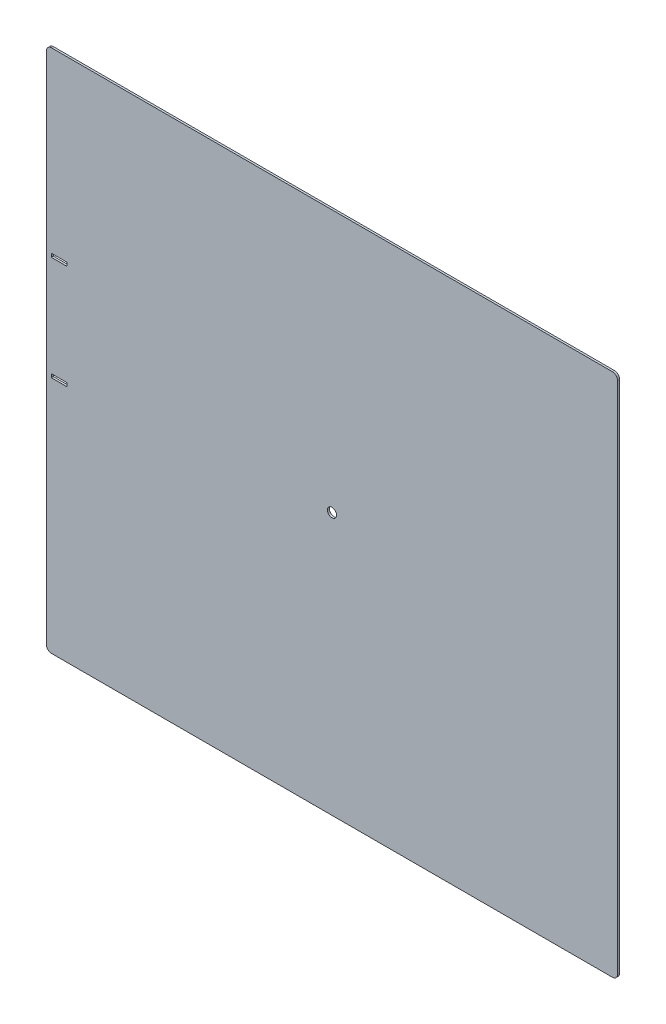
ISO-10303-21;
HEADER;
FILE_DESCRIPTION(('STEP AP214'),'2;1');
FILE_NAME('part.step','',(''),(''),'','','');
FILE_SCHEMA(('AUTOMOTIVE_DESIGN { 1 0 10303 214 1 1 1 1 }'));
ENDSEC;
DATA;
#1=APPLICATION_CONTEXT('core data for automotive mechanical design processes');
#2=APPLICATION_PROTOCOL_DEFINITION('international standard','automotive_design',2000,#1);
#3=PRODUCT_CONTEXT('',#1,'mechanical');
#4=PRODUCT('Part','Part','',(#3));
#5=PRODUCT_RELATED_PRODUCT_CATEGORY('part','',(#4));
#6=PRODUCT_DEFINITION_FORMATION('','',#4);
#7=PRODUCT_DEFINITION_CONTEXT('part definition',#1,'design');
#8=PRODUCT_DEFINITION('design','',#6,#7);
#9=PRODUCT_DEFINITION_SHAPE('','',#8);
#10=(LENGTH_UNIT() NAMED_UNIT(*) SI_UNIT(.MILLI.,.METRE.));
#11=(NAMED_UNIT(*) PLANE_ANGLE_UNIT() SI_UNIT($,.RADIAN.));
#12=(NAMED_UNIT(*) SI_UNIT($,.STERADIAN.) SOLID_ANGLE_UNIT());
#13=UNCERTAINTY_MEASURE_WITH_UNIT(LENGTH_MEASURE(1.E-05),#10,'distance_accuracy_value','');
#14=(GEOMETRIC_REPRESENTATION_CONTEXT(3) GLOBAL_UNCERTAINTY_ASSIGNED_CONTEXT((#13)) GLOBAL_UNIT_ASSIGNED_CONTEXT((#10,
#11,#12)) REPRESENTATION_CONTEXT('',''));
#15=CARTESIAN_POINT('',(0.,0.,0.));
#16=DIRECTION('',(0.,0.,1.));
#17=DIRECTION('',(1.,0.,0.));
#18=AXIS2_PLACEMENT_3D('',#15,#16,#17);
#19=CARTESIAN_POINT('',(0.,0.,-2.));
#20=DIRECTION('',(0.,0.,1.));
#21=DIRECTION('',(1.,0.,0.));
#22=AXIS2_PLACEMENT_3D('',#19,#20,#21);
#23=PLANE('',#22);
#24=CARTESIAN_POINT('',(-261.75,-19.75,-1.99999999999999));
#25=CARTESIAN_POINT('',(-261.75,-23.25,-1.99999999999999));
#26=B_SPLINE_CURVE_WITH_KNOTS('',1,(#24,#25),.UNSPECIFIED.,.F.,.F.,(2,2),(0.5,
0.592105263157895),.UNSPECIFIED.);
#27=CARTESIAN_POINT('',(-261.75,-19.75,-1.99999999999999));
#28=VERTEX_POINT('',#27);
#29=CARTESIAN_POINT('',(-261.75,-23.25,-1.99999999999999));
#30=VERTEX_POINT('',#29);
#31=EDGE_CURVE('E176',#28,#30,#26,.T.);
#32=ORIENTED_EDGE('',*,*,#31,.F.);
#33=CARTESIAN_POINT('',(-277.25,-19.75,-1.99999999999999));
#34=CARTESIAN_POINT('',(-261.75,-19.75,-1.99999999999999));
#35=B_SPLINE_CURVE_WITH_KNOTS('',1,(#33,#34),.UNSPECIFIED.,.F.,.F.,(2,2),(0.0921052631578946,
0.5),.UNSPECIFIED.);
#36=CARTESIAN_POINT('',(-277.25,-19.75,-1.99999999999999));
#37=VERTEX_POINT('',#36);
#38=EDGE_CURVE('E169',#37,#28,#35,.T.);
#39=ORIENTED_EDGE('',*,*,#38,.F.);
#40=CARTESIAN_POINT('',(-277.25,-23.25,-1.99999999999999));
#41=CARTESIAN_POINT('',(-277.25,-19.75,-1.99999999999999));
#42=B_SPLINE_CURVE_WITH_KNOTS('',1,(#40,#41),.UNSPECIFIED.,.F.,.F.,(2,2),(0.,
0.0921052631578946),.UNSPECIFIED.);
#43=CARTESIAN_POINT('',(-277.25,-23.25,-2.));
#44=VERTEX_POINT('',#43);
#45=EDGE_CURVE('E180',#44,#37,#42,.T.);
#46=ORIENTED_EDGE('',*,*,#45,.F.);
#47=CARTESIAN_POINT('',(-261.75,-23.25,-1.99999999999999));
#48=CARTESIAN_POINT('',(-277.25,-23.25,-1.99999999999999));
#49=B_SPLINE_CURVE_WITH_KNOTS('',1,(#47,#48),.UNSPECIFIED.,.F.,.F.,(2,2),(0.592105263157895,1.),.UNSPECIFIED.);
#50=EDGE_CURVE('E54',#30,#44,#49,.T.);
#51=ORIENTED_EDGE('',*,*,#50,.F.);
#52=EDGE_LOOP('',(#32,#39,#46,#51));
#53=FACE_BOUND('',#52,.T.);
#54=DIRECTION('',(0.,1.,0.));
#55=VECTOR('',#54,1.);
#56=CARTESIAN_POINT('',(282.,259.,-2.));
#57=LINE('',#56,#55);
#58=CARTESIAN_POINT('',(282.,-254.,-2.));
#59=VERTEX_POINT('',#58);
#60=CARTESIAN_POINT('',(282.,254.,-2.));
#61=VERTEX_POINT('',#60);
#62=EDGE_CURVE('E272',#59,#61,#57,.T.);
#63=ORIENTED_EDGE('',*,*,#62,.F.);
#64=CARTESIAN_POINT('',(277.,-254.,-2.));
#65=DIRECTION('',(0.,0.,1.));
#66=DIRECTION('',(1.,0.,0.));
#67=AXIS2_PLACEMENT_3D('',#64,#65,#66);
#68=CIRCLE('',#67,5.);
#69=CARTESIAN_POINT('',(277.,-259.,-2.));
#70=VERTEX_POINT('',#69);
#71=EDGE_CURVE('E307',#59,#70,#68,.F.);
#72=ORIENTED_EDGE('',*,*,#71,.T.);
#73=DIRECTION('',(1.,0.,0.));
#74=VECTOR('',#73,1.);
#75=CARTESIAN_POINT('',(-282.,-259.,-2.));
#76=LINE('',#75,#74);
#77=CARTESIAN_POINT('',(-277.,-259.,-2.));
#78=VERTEX_POINT('',#77);
#79=EDGE_CURVE('E259',#78,#70,#76,.T.);
#80=ORIENTED_EDGE('',*,*,#79,.F.);
#81=CARTESIAN_POINT('',(-277.,-254.,-2.));
#82=DIRECTION('',(0.,0.,1.));
#83=DIRECTION('',(1.,0.,0.));
#84=AXIS2_PLACEMENT_3D('',#81,#82,#83);
#85=CIRCLE('',#84,5.);
#86=CARTESIAN_POINT('',(-282.,-254.,-2.));
#87=VERTEX_POINT('',#86);
#88=EDGE_CURVE('E305',#78,#87,#85,.F.);
#89=ORIENTED_EDGE('',*,*,#88,.T.);
#90=DIRECTION('',(0.,-1.,0.));
#91=VECTOR('',#90,1.);
#92=CARTESIAN_POINT('',(-282.,259.,-2.));
#93=LINE('',#92,#91);
#94=CARTESIAN_POINT('',(-282.,254.,-2.));
#95=VERTEX_POINT('',#94);
#96=EDGE_CURVE('E255',#95,#87,#93,.T.);
#97=ORIENTED_EDGE('',*,*,#96,.F.);
#98=CARTESIAN_POINT('',(-277.,254.,-2.));
#99=DIRECTION('',(0.,0.,1.));
#100=DIRECTION('',(1.,0.,0.));
#101=AXIS2_PLACEMENT_3D('',#98,#99,#100);
#102=CIRCLE('',#101,5.);
#103=CARTESIAN_POINT('',(-277.,259.,-2.));
#104=VERTEX_POINT('',#103);
#105=EDGE_CURVE('E303',#95,#104,#102,.F.);
#106=ORIENTED_EDGE('',*,*,#105,.T.);
#107=DIRECTION('',(-1.,0.,0.));
#108=VECTOR('',#107,1.);
#109=CARTESIAN_POINT('',(-282.,259.,-2.));
#110=LINE('',#109,#108);
#111=CARTESIAN_POINT('',(277.,259.,-2.));
#112=VERTEX_POINT('',#111);
#113=EDGE_CURVE('E267',#112,#104,#110,.T.);
#114=ORIENTED_EDGE('',*,*,#113,.F.);
#115=CARTESIAN_POINT('',(277.,254.,-2.));
#116=DIRECTION('',(0.,0.,1.));
#117=DIRECTION('',(1.,0.,0.));
#118=AXIS2_PLACEMENT_3D('',#115,#116,#117);
#119=CIRCLE('',#118,5.);
#120=EDGE_CURVE('E301',#112,#61,#119,.F.);
#121=ORIENTED_EDGE('',*,*,#120,.T.);
#122=EDGE_LOOP('',(#63,#72,#80,#89,#97,#106,#114,#121));
#123=FACE_BOUND('',#122,.T.);
#124=CARTESIAN_POINT('',(0.,0.,-2.));
#125=DIRECTION('',(0.,0.,1.));
#126=DIRECTION('',(1.,0.,0.));
#127=AXIS2_PLACEMENT_3D('',#124,#125,#126);
#128=CIRCLE('',#127,4.5);
#129=CARTESIAN_POINT('',(4.5,0.,-2.));
#130=VERTEX_POINT('',#129);
#131=EDGE_CURVE('E248',#130,#130,#128,.T.);
#132=ORIENTED_EDGE('',*,*,#131,.T.);
#133=EDGE_LOOP('',(#132));
#134=FACE_BOUND('',#133,.T.);
#135=CARTESIAN_POINT('',(-277.25,83.25,-1.99999999999992));
#136=CARTESIAN_POINT('',(-277.25,79.75,-1.99999999999992));
#137=B_SPLINE_CURVE_WITH_KNOTS('',1,(#135,#136),.UNSPECIFIED.,.F.,.F.,(2,2),(0.,
0.0921052631578947),.UNSPECIFIED.);
#138=CARTESIAN_POINT('',(-277.25,83.25,-2.));
#139=VERTEX_POINT('',#138);
#140=CARTESIAN_POINT('',(-277.25,79.75,-1.99999999999992));
#141=VERTEX_POINT('',#140);
#142=EDGE_CURVE('E223',#139,#141,#137,.T.);
#143=ORIENTED_EDGE('',*,*,#142,.T.);
#144=CARTESIAN_POINT('',(-277.25,79.75,-1.99999999999992));
#145=CARTESIAN_POINT('',(-261.75,79.75,-1.99999999999992));
#146=B_SPLINE_CURVE_WITH_KNOTS('',1,(#144,#145),.UNSPECIFIED.,.F.,.F.,(2,2),(0.0921052631578947,
0.5),.UNSPECIFIED.);
#147=CARTESIAN_POINT('',(-261.75,79.75,-1.99999999999992));
#148=VERTEX_POINT('',#147);
#149=EDGE_CURVE('E210',#141,#148,#146,.T.);
#150=ORIENTED_EDGE('',*,*,#149,.T.);
#151=CARTESIAN_POINT('',(-261.75,79.75,-1.99999999999992));
#152=CARTESIAN_POINT('',(-261.75,83.25,-1.99999999999992));
#153=B_SPLINE_CURVE_WITH_KNOTS('',1,(#151,#152),.UNSPECIFIED.,.F.,.F.,(2,2),(0.5,
0.592105263157895),.UNSPECIFIED.);
#154=CARTESIAN_POINT('',(-261.75,83.25,-1.99999999999992));
#155=VERTEX_POINT('',#154);
#156=EDGE_CURVE('E200',#148,#155,#153,.T.);
#157=ORIENTED_EDGE('',*,*,#156,.T.);
#158=CARTESIAN_POINT('',(-261.75,83.25,-1.99999999999992));
#159=CARTESIAN_POINT('',(-277.25,83.25,-1.99999999999992));
#160=B_SPLINE_CURVE_WITH_KNOTS('',1,(#158,#159),.UNSPECIFIED.,.F.,.F.,(2,2),(0.592105263157895,
1.),.UNSPECIFIED.);
#161=EDGE_CURVE('E192',#155,#139,#160,.T.);
#162=ORIENTED_EDGE('',*,*,#161,.T.);
#163=EDGE_LOOP('',(#143,#150,#157,#162));
#164=FACE_BOUND('',#163,.T.);
#165=ADVANCED_FACE('F39',(#53,#123,#134,#164),#23,.F.);
#166=CARTESIAN_POINT('',(0.,0.,0.));
#167=DIRECTION('',(0.,0.,1.));
#168=DIRECTION('',(1.,0.,0.));
#169=AXIS2_PLACEMENT_3D('',#166,#167,#168);
#170=PLANE('',#169);
#171=DIRECTION('',(1.,0.,0.));
#172=VECTOR('',#171,1.);
#173=CARTESIAN_POINT('',(-277.25,-19.75,0.));
#174=LINE('',#173,#172);
#175=CARTESIAN_POINT('',(-277.25,-19.75,0.));
#176=VERTEX_POINT('',#175);
#177=CARTESIAN_POINT('',(-261.75,-19.75,0.));
#178=VERTEX_POINT('',#177);
#179=EDGE_CURVE('E166',#176,#178,#174,.T.);
#180=ORIENTED_EDGE('',*,*,#179,.T.);
#181=DIRECTION('',(0.,-1.,0.));
#182=VECTOR('',#181,1.);
#183=CARTESIAN_POINT('',(-261.75,-19.75,0.));
#184=LINE('',#183,#182);
#185=CARTESIAN_POINT('',(-261.75,-23.25,0.));
#186=VERTEX_POINT('',#185);
#187=EDGE_CURVE('E153',#178,#186,#184,.T.);
#188=ORIENTED_EDGE('',*,*,#187,.T.);
#189=DIRECTION('',(-1.,0.,0.));
#190=VECTOR('',#189,1.);
#191=CARTESIAN_POINT('',(-261.75,-23.25,0.));
#192=LINE('',#191,#190);
#193=CARTESIAN_POINT('',(-277.25,-23.25,0.));
#194=VERTEX_POINT('',#193);
#195=EDGE_CURVE('E187',#186,#194,#192,.T.);
#196=ORIENTED_EDGE('',*,*,#195,.T.);
#197=DIRECTION('',(0.,1.,0.));
#198=VECTOR('',#197,1.);
#199=CARTESIAN_POINT('',(-277.25,-23.25,0.));
#200=LINE('',#199,#198);
#201=EDGE_CURVE('E174',#194,#176,#200,.T.);
#202=ORIENTED_EDGE('',*,*,#201,.T.);
#203=EDGE_LOOP('',(#180,#188,#196,#202));
#204=FACE_BOUND('',#203,.T.);
#205=CARTESIAN_POINT('',(0.,0.,0.));
#206=DIRECTION('',(0.,0.,1.));
#207=DIRECTION('',(1.,0.,0.));
#208=AXIS2_PLACEMENT_3D('',#205,#206,#207);
#209=CIRCLE('',#208,4.5);
#210=CARTESIAN_POINT('',(4.5,0.,0.));
#211=VERTEX_POINT('',#210);
#212=EDGE_CURVE('E235',#211,#211,#209,.T.);
#213=ORIENTED_EDGE('',*,*,#212,.F.);
#214=EDGE_LOOP('',(#213));
#215=FACE_BOUND('',#214,.T.);
#216=DIRECTION('',(1.,0.,0.));
#217=VECTOR('',#216,1.);
#218=CARTESIAN_POINT('',(-282.,-259.,0.));
#219=LINE('',#218,#217);
#220=CARTESIAN_POINT('',(-277.,-259.,0.));
#221=VERTEX_POINT('',#220);
#222=CARTESIAN_POINT('',(277.,-259.,0.));
#223=VERTEX_POINT('',#222);
#224=EDGE_CURVE('E276',#221,#223,#219,.T.);
#225=ORIENTED_EDGE('',*,*,#224,.T.);
#226=CARTESIAN_POINT('',(277.,-254.,0.));
#227=DIRECTION('',(0.,0.,1.));
#228=DIRECTION('',(1.,0.,0.));
#229=AXIS2_PLACEMENT_3D('',#226,#227,#228);
#230=CIRCLE('',#229,5.);
#231=CARTESIAN_POINT('',(282.,-254.,0.));
#232=VERTEX_POINT('',#231);
#233=EDGE_CURVE('E294',#223,#232,#230,.T.);
#234=ORIENTED_EDGE('',*,*,#233,.T.);
#235=DIRECTION('',(0.,1.,0.));
#236=VECTOR('',#235,1.);
#237=CARTESIAN_POINT('',(282.,259.,0.));
#238=LINE('',#237,#236);
#239=CARTESIAN_POINT('',(282.,254.,0.));
#240=VERTEX_POINT('',#239);
#241=EDGE_CURVE('E279',#232,#240,#238,.T.);
#242=ORIENTED_EDGE('',*,*,#241,.T.);
#243=CARTESIAN_POINT('',(277.,254.,0.));
#244=DIRECTION('',(0.,0.,1.));
#245=DIRECTION('',(1.,0.,0.));
#246=AXIS2_PLACEMENT_3D('',#243,#244,#245);
#247=CIRCLE('',#246,5.);
#248=CARTESIAN_POINT('',(277.,259.,0.));
#249=VERTEX_POINT('',#248);
#250=EDGE_CURVE('E288',#240,#249,#247,.T.);
#251=ORIENTED_EDGE('',*,*,#250,.T.);
#252=DIRECTION('',(-1.,0.,0.));
#253=VECTOR('',#252,1.);
#254=CARTESIAN_POINT('',(-282.,259.,0.));
#255=LINE('',#254,#253);
#256=CARTESIAN_POINT('',(-277.,259.,0.));
#257=VERTEX_POINT('',#256);
#258=EDGE_CURVE('E260',#249,#257,#255,.T.);
#259=ORIENTED_EDGE('',*,*,#258,.T.);
#260=CARTESIAN_POINT('',(-277.,254.,0.));
#261=DIRECTION('',(0.,0.,1.));
#262=DIRECTION('',(1.,0.,0.));
#263=AXIS2_PLACEMENT_3D('',#260,#261,#262);
#264=CIRCLE('',#263,5.);
#265=CARTESIAN_POINT('',(-282.,254.,0.));
#266=VERTEX_POINT('',#265);
#267=EDGE_CURVE('E290',#257,#266,#264,.T.);
#268=ORIENTED_EDGE('',*,*,#267,.T.);
#269=DIRECTION('',(0.,-1.,0.));
#270=VECTOR('',#269,1.);
#271=CARTESIAN_POINT('',(-282.,259.,0.));
#272=LINE('',#271,#270);
#273=CARTESIAN_POINT('',(-282.,-254.,0.));
#274=VERTEX_POINT('',#273);
#275=EDGE_CURVE('E252',#266,#274,#272,.T.);
#276=ORIENTED_EDGE('',*,*,#275,.T.);
#277=CARTESIAN_POINT('',(-277.,-254.,0.));
#278=DIRECTION('',(0.,0.,1.));
#279=DIRECTION('',(1.,0.,0.));
#280=AXIS2_PLACEMENT_3D('',#277,#278,#279);
#281=CIRCLE('',#280,5.);
#282=EDGE_CURVE('E292',#274,#221,#281,.T.);
#283=ORIENTED_EDGE('',*,*,#282,.T.);
#284=EDGE_LOOP('',(#225,#234,#242,#251,#259,#268,#276,#283));
#285=FACE_BOUND('',#284,.T.);
#286=DIRECTION('',(1.,0.,0.));
#287=VECTOR('',#286,1.);
#288=CARTESIAN_POINT('',(-277.25,79.75,0.));
#289=LINE('',#288,#287);
#290=CARTESIAN_POINT('',(-277.25,79.75,0.));
#291=VERTEX_POINT('',#290);
#292=CARTESIAN_POINT('',(-261.75,79.75,0.));
#293=VERTEX_POINT('',#292);
#294=EDGE_CURVE('E236',#291,#293,#289,.T.);
#295=ORIENTED_EDGE('',*,*,#294,.F.);
#296=DIRECTION('',(0.,-1.,0.));
#297=VECTOR('',#296,1.);
#298=CARTESIAN_POINT('',(-277.25,83.25,0.));
#299=LINE('',#298,#297);
#300=CARTESIAN_POINT('',(-277.25,83.25,0.));
#301=VERTEX_POINT('',#300);
#302=EDGE_CURVE('E239',#301,#291,#299,.T.);
#303=ORIENTED_EDGE('',*,*,#302,.F.);
#304=DIRECTION('',(-1.,0.,0.));
#305=VECTOR('',#304,1.);
#306=CARTESIAN_POINT('',(-261.75,83.25,0.));
#307=LINE('',#306,#305);
#308=CARTESIAN_POINT('',(-261.75,83.25,0.));
#309=VERTEX_POINT('',#308);
#310=EDGE_CURVE('E198',#309,#301,#307,.T.);
#311=ORIENTED_EDGE('',*,*,#310,.F.);
#312=DIRECTION('',(0.,1.,0.));
#313=VECTOR('',#312,1.);
#314=CARTESIAN_POINT('',(-261.75,79.75,0.));
#315=LINE('',#314,#313);
#316=EDGE_CURVE('E230',#293,#309,#315,.T.);
#317=ORIENTED_EDGE('',*,*,#316,.F.);
#318=EDGE_LOOP('',(#295,#303,#311,#317));
#319=FACE_BOUND('',#318,.T.);
#320=ADVANCED_FACE('F172',(#204,#215,#285,#319),#170,.T.);
#321=CARTESIAN_POINT('',(-282.,259.,-2.));
#322=DIRECTION('',(-1.,0.,0.));
#323=DIRECTION('',(0.,-1.,0.));
#324=AXIS2_PLACEMENT_3D('',#321,#322,#323);
#325=PLANE('',#324);
#326=ORIENTED_EDGE('',*,*,#96,.T.);
#327=DIRECTION('',(0.,0.,1.));
#328=VECTOR('',#327,1.);
#329=CARTESIAN_POINT('',(-282.,-254.,-2.));
#330=LINE('',#329,#328);
#331=EDGE_CURVE('E311',#87,#274,#330,.T.);
#332=ORIENTED_EDGE('',*,*,#331,.T.);
#333=ORIENTED_EDGE('',*,*,#275,.F.);
#334=DIRECTION('',(0.,0.,1.));
#335=VECTOR('',#334,1.);
#336=CARTESIAN_POINT('',(-282.,254.,-2.));
#337=LINE('',#336,#335);
#338=EDGE_CURVE('E309',#266,#95,#337,.F.);
#339=ORIENTED_EDGE('',*,*,#338,.T.);
#340=EDGE_LOOP('',(#326,#332,#333,#339));
#341=FACE_BOUND('',#340,.T.);
#342=ADVANCED_FACE('F350',(#341),#325,.T.);
#343=CARTESIAN_POINT('',(-282.,259.,-2.));
#344=DIRECTION('',(0.,1.,0.));
#345=DIRECTION('',(0.,0.,1.));
#346=AXIS2_PLACEMENT_3D('',#343,#344,#345);
#347=PLANE('',#346);
#348=ORIENTED_EDGE('',*,*,#113,.T.);
#349=DIRECTION('',(0.,0.,1.));
#350=VECTOR('',#349,1.);
#351=CARTESIAN_POINT('',(-277.,259.,-2.));
#352=LINE('',#351,#350);
#353=EDGE_CURVE('E12',#104,#257,#352,.T.);
#354=ORIENTED_EDGE('',*,*,#353,.T.);
#355=ORIENTED_EDGE('',*,*,#258,.F.);
#356=DIRECTION('',(0.,0.,1.));
#357=VECTOR('',#356,1.);
#358=CARTESIAN_POINT('',(277.,259.,-2.));
#359=LINE('',#358,#357);
#360=EDGE_CURVE('E47',#249,#112,#359,.F.);
#361=ORIENTED_EDGE('',*,*,#360,.T.);
#362=EDGE_LOOP('',(#348,#354,#355,#361));
#363=FACE_BOUND('',#362,.T.);
#364=ADVANCED_FACE('F317',(#363),#347,.T.);
#365=CARTESIAN_POINT('',(282.,259.,-2.));
#366=DIRECTION('',(1.,0.,0.));
#367=DIRECTION('',(0.,0.,-1.));
#368=AXIS2_PLACEMENT_3D('',#365,#366,#367);
#369=PLANE('',#368);
#370=ORIENTED_EDGE('',*,*,#241,.F.);
#371=DIRECTION('',(0.,0.,1.));
#372=VECTOR('',#371,1.);
#373=CARTESIAN_POINT('',(282.,-254.,-2.));
#374=LINE('',#373,#372);
#375=EDGE_CURVE('E299',#232,#59,#374,.F.);
#376=ORIENTED_EDGE('',*,*,#375,.T.);
#377=ORIENTED_EDGE('',*,*,#62,.T.);
#378=DIRECTION('',(0.,0.,1.));
#379=VECTOR('',#378,1.);
#380=CARTESIAN_POINT('',(282.,254.,-2.));
#381=LINE('',#380,#379);
#382=EDGE_CURVE('E296',#61,#240,#381,.T.);
#383=ORIENTED_EDGE('',*,*,#382,.T.);
#384=EDGE_LOOP('',(#370,#376,#377,#383));
#385=FACE_BOUND('',#384,.T.);
#386=ADVANCED_FACE('F330',(#385),#369,.T.);
#387=CARTESIAN_POINT('',(-282.,-259.,-2.));
#388=DIRECTION('',(0.,-1.,0.));
#389=DIRECTION('',(0.,0.,-1.));
#390=AXIS2_PLACEMENT_3D('',#387,#388,#389);
#391=PLANE('',#390);
#392=ORIENTED_EDGE('',*,*,#79,.T.);
#393=DIRECTION('',(0.,0.,1.));
#394=VECTOR('',#393,1.);
#395=CARTESIAN_POINT('',(277.,-259.,-2.));
#396=LINE('',#395,#394);
#397=EDGE_CURVE('E285',#70,#223,#396,.T.);
#398=ORIENTED_EDGE('',*,*,#397,.T.);
#399=ORIENTED_EDGE('',*,*,#224,.F.);
#400=DIRECTION('',(0.,0.,1.));
#401=VECTOR('',#400,1.);
#402=CARTESIAN_POINT('',(-277.,-259.,-2.));
#403=LINE('',#402,#401);
#404=EDGE_CURVE('E271',#221,#78,#403,.F.);
#405=ORIENTED_EDGE('',*,*,#404,.T.);
#406=EDGE_LOOP('',(#392,#398,#399,#405));
#407=FACE_BOUND('',#406,.T.);
#408=ADVANCED_FACE('F341',(#407),#391,.T.);
#409=CARTESIAN_POINT('',(0.,0.,-2.));
#410=DIRECTION('',(0.,0.,1.));
#411=DIRECTION('',(1.,0.,0.));
#412=AXIS2_PLACEMENT_3D('',#409,#410,#411);
#413=CYLINDRICAL_SURFACE('',#412,4.5);
#414=ORIENTED_EDGE('',*,*,#131,.F.);
#415=EDGE_LOOP('',(#414));
#416=FACE_BOUND('',#415,.T.);
#417=ORIENTED_EDGE('',*,*,#212,.T.);
#418=EDGE_LOOP('',(#417));
#419=FACE_BOUND('',#418,.T.);
#420=ADVANCED_FACE('F371',(#416,#419),#413,.F.);
#421=CARTESIAN_POINT('',(277.,-254.,-2.));
#422=DIRECTION('',(0.,0.,1.));
#423=DIRECTION('',(1.,0.,0.));
#424=AXIS2_PLACEMENT_3D('',#421,#422,#423);
#425=CYLINDRICAL_SURFACE('',#424,5.);
#426=ORIENTED_EDGE('',*,*,#71,.F.);
#427=ORIENTED_EDGE('',*,*,#375,.F.);
#428=ORIENTED_EDGE('',*,*,#233,.F.);
#429=ORIENTED_EDGE('',*,*,#397,.F.);
#430=EDGE_LOOP('',(#426,#427,#428,#429));
#431=FACE_BOUND('',#430,.T.);
#432=ADVANCED_FACE('F338',(#431),#425,.T.);
#433=CARTESIAN_POINT('',(-277.,-254.,-2.));
#434=DIRECTION('',(0.,0.,1.));
#435=DIRECTION('',(1.,0.,0.));
#436=AXIS2_PLACEMENT_3D('',#433,#434,#435);
#437=CYLINDRICAL_SURFACE('',#436,5.);
#438=ORIENTED_EDGE('',*,*,#88,.F.);
#439=ORIENTED_EDGE('',*,*,#404,.F.);
#440=ORIENTED_EDGE('',*,*,#282,.F.);
#441=ORIENTED_EDGE('',*,*,#331,.F.);
#442=EDGE_LOOP('',(#438,#439,#440,#441));
#443=FACE_BOUND('',#442,.T.);
#444=ADVANCED_FACE('F347',(#443),#437,.T.);
#445=CARTESIAN_POINT('',(-277.,254.,-2.));
#446=DIRECTION('',(0.,0.,1.));
#447=DIRECTION('',(1.,0.,0.));
#448=AXIS2_PLACEMENT_3D('',#445,#446,#447);
#449=CYLINDRICAL_SURFACE('',#448,5.);
#450=ORIENTED_EDGE('',*,*,#105,.F.);
#451=ORIENTED_EDGE('',*,*,#338,.F.);
#452=ORIENTED_EDGE('',*,*,#267,.F.);
#453=ORIENTED_EDGE('',*,*,#353,.F.);
#454=EDGE_LOOP('',(#450,#451,#452,#453));
#455=FACE_BOUND('',#454,.T.);
#456=ADVANCED_FACE('F353',(#455),#449,.T.);
#457=CARTESIAN_POINT('',(277.,254.,-2.));
#458=DIRECTION('',(0.,0.,1.));
#459=DIRECTION('',(1.,0.,0.));
#460=AXIS2_PLACEMENT_3D('',#457,#458,#459);
#461=CYLINDRICAL_SURFACE('',#460,5.);
#462=ORIENTED_EDGE('',*,*,#120,.F.);
#463=ORIENTED_EDGE('',*,*,#360,.F.);
#464=ORIENTED_EDGE('',*,*,#250,.F.);
#465=ORIENTED_EDGE('',*,*,#382,.F.);
#466=EDGE_LOOP('',(#462,#463,#464,#465));
#467=FACE_BOUND('',#466,.T.);
#468=ADVANCED_FACE('F41',(#467),#461,.T.);
#469=CARTESIAN_POINT('',(-277.25,83.25,1.99999999999992));
#470=DIRECTION('',(1.,0.,0.));
#471=DIRECTION('',(0.,0.,-1.));
#472=AXIS2_PLACEMENT_3D('',#469,#470,#471);
#473=PLANE('',#472);
#474=ORIENTED_EDGE('',*,*,#302,.T.);
#475=DIRECTION('',(0.,0.,-1.));
#476=VECTOR('',#475,1.);
#477=CARTESIAN_POINT('',(-277.25,79.75,1.99999999999992));
#478=LINE('',#477,#476);
#479=EDGE_CURVE('E229',#291,#141,#478,.T.);
#480=ORIENTED_EDGE('',*,*,#479,.T.);
#481=ORIENTED_EDGE('',*,*,#142,.F.);
#482=DIRECTION('',(0.,0.,-1.));
#483=VECTOR('',#482,1.);
#484=CARTESIAN_POINT('',(-277.25,83.25,1.99999999999992));
#485=LINE('',#484,#483);
#486=EDGE_CURVE('E191',#301,#139,#485,.T.);
#487=ORIENTED_EDGE('',*,*,#486,.F.);
#488=EDGE_LOOP('',(#474,#480,#481,#487));
#489=FACE_BOUND('',#488,.T.);
#490=ADVANCED_FACE('F360',(#489),#473,.T.);
#491=CARTESIAN_POINT('',(-277.25,79.75,1.99999999999992));
#492=DIRECTION('',(0.,1.,0.));
#493=DIRECTION('',(0.,0.,1.));
#494=AXIS2_PLACEMENT_3D('',#491,#492,#493);
#495=PLANE('',#494);
#496=ORIENTED_EDGE('',*,*,#294,.T.);
#497=DIRECTION('',(0.,0.,-1.));
#498=VECTOR('',#497,1.);
#499=CARTESIAN_POINT('',(-261.75,79.75,1.99999999999992));
#500=LINE('',#499,#498);
#501=EDGE_CURVE('E209',#293,#148,#500,.T.);
#502=ORIENTED_EDGE('',*,*,#501,.T.);
#503=ORIENTED_EDGE('',*,*,#149,.F.);
#504=ORIENTED_EDGE('',*,*,#479,.F.);
#505=EDGE_LOOP('',(#496,#502,#503,#504));
#506=FACE_BOUND('',#505,.T.);
#507=ADVANCED_FACE('F407',(#506),#495,.T.);
#508=CARTESIAN_POINT('',(-261.75,79.75,1.99999999999992));
#509=DIRECTION('',(-1.,0.,0.));
#510=DIRECTION('',(0.,0.,1.));
#511=AXIS2_PLACEMENT_3D('',#508,#509,#510);
#512=PLANE('',#511);
#513=ORIENTED_EDGE('',*,*,#316,.T.);
#514=DIRECTION('',(0.,0.,-1.));
#515=VECTOR('',#514,1.);
#516=CARTESIAN_POINT('',(-261.75,83.25,1.99999999999992));
#517=LINE('',#516,#515);
#518=EDGE_CURVE('E199',#309,#155,#517,.T.);
#519=ORIENTED_EDGE('',*,*,#518,.T.);
#520=ORIENTED_EDGE('',*,*,#156,.F.);
#521=ORIENTED_EDGE('',*,*,#501,.F.);
#522=EDGE_LOOP('',(#513,#519,#520,#521));
#523=FACE_BOUND('',#522,.T.);
#524=ADVANCED_FACE('F410',(#523),#512,.T.);
#525=CARTESIAN_POINT('',(-261.75,83.25,1.99999999999992));
#526=DIRECTION('',(0.,-1.,0.));
#527=DIRECTION('',(0.,0.,-1.));
#528=AXIS2_PLACEMENT_3D('',#525,#526,#527);
#529=PLANE('',#528);
#530=ORIENTED_EDGE('',*,*,#310,.T.);
#531=ORIENTED_EDGE('',*,*,#486,.T.);
#532=ORIENTED_EDGE('',*,*,#161,.F.);
#533=ORIENTED_EDGE('',*,*,#518,.F.);
#534=EDGE_LOOP('',(#530,#531,#532,#533));
#535=FACE_BOUND('',#534,.T.);
#536=ADVANCED_FACE('F400',(#535),#529,.T.);
#537=CARTESIAN_POINT('',(-277.25,-19.75,1.99999999999999));
#538=DIRECTION('',(0.,1.,0.));
#539=DIRECTION('',(0.,0.,1.));
#540=AXIS2_PLACEMENT_3D('',#537,#538,#539);
#541=PLANE('',#540);
#542=DIRECTION('',(0.,0.,-1.));
#543=VECTOR('',#542,1.);
#544=CARTESIAN_POINT('',(-277.25,-19.75,1.99999999999999));
#545=LINE('',#544,#543);
#546=EDGE_CURVE('E62',#176,#37,#545,.T.);
#547=ORIENTED_EDGE('',*,*,#546,.T.);
#548=ORIENTED_EDGE('',*,*,#38,.T.);
#549=DIRECTION('',(0.,0.,-1.));
#550=VECTOR('',#549,1.);
#551=CARTESIAN_POINT('',(-261.75,-19.75,1.99999999999999));
#552=LINE('',#551,#550);
#553=EDGE_CURVE('E157',#178,#28,#552,.T.);
#554=ORIENTED_EDGE('',*,*,#553,.F.);
#555=ORIENTED_EDGE('',*,*,#179,.F.);
#556=EDGE_LOOP('',(#547,#548,#554,#555));
#557=FACE_BOUND('',#556,.T.);
#558=ADVANCED_FACE('F165',(#557),#541,.F.);
#559=CARTESIAN_POINT('',(-261.75,-19.75,1.99999999999999));
#560=DIRECTION('',(1.,0.,0.));
#561=DIRECTION('',(0.,0.,-1.));
#562=AXIS2_PLACEMENT_3D('',#559,#560,#561);
#563=PLANE('',#562);
#564=ORIENTED_EDGE('',*,*,#553,.T.);
#565=ORIENTED_EDGE('',*,*,#31,.T.);
#566=DIRECTION('',(0.,0.,-1.));
#567=VECTOR('',#566,1.);
#568=CARTESIAN_POINT('',(-261.75,-23.25,1.99999999999999));
#569=LINE('',#568,#567);
#570=EDGE_CURVE('E159',#186,#30,#569,.T.);
#571=ORIENTED_EDGE('',*,*,#570,.F.);
#572=ORIENTED_EDGE('',*,*,#187,.F.);
#573=EDGE_LOOP('',(#564,#565,#571,#572));
#574=FACE_BOUND('',#573,.T.);
#575=ADVANCED_FACE('F155',(#574),#563,.F.);
#576=CARTESIAN_POINT('',(-261.75,-23.25,1.99999999999999));
#577=DIRECTION('',(0.,-1.,0.));
#578=DIRECTION('',(0.,0.,-1.));
#579=AXIS2_PLACEMENT_3D('',#576,#577,#578);
#580=PLANE('',#579);
#581=ORIENTED_EDGE('',*,*,#570,.T.);
#582=ORIENTED_EDGE('',*,*,#50,.T.);
#583=DIRECTION('',(0.,0.,-1.));
#584=VECTOR('',#583,1.);
#585=CARTESIAN_POINT('',(-277.25,-23.25,1.99999999999999));
#586=LINE('',#585,#584);
#587=EDGE_CURVE('E186',#194,#44,#586,.T.);
#588=ORIENTED_EDGE('',*,*,#587,.F.);
#589=ORIENTED_EDGE('',*,*,#195,.F.);
#590=EDGE_LOOP('',(#581,#582,#588,#589));
#591=FACE_BOUND('',#590,.T.);
#592=ADVANCED_FACE('F522',(#591),#580,.F.);
#593=CARTESIAN_POINT('',(-277.25,-23.25,1.99999999999999));
#594=DIRECTION('',(-1.,0.,0.));
#595=DIRECTION('',(0.,0.,1.));
#596=AXIS2_PLACEMENT_3D('',#593,#594,#595);
#597=PLANE('',#596);
#598=ORIENTED_EDGE('',*,*,#587,.T.);
#599=ORIENTED_EDGE('',*,*,#45,.T.);
#600=ORIENTED_EDGE('',*,*,#546,.F.);
#601=ORIENTED_EDGE('',*,*,#201,.F.);
#602=EDGE_LOOP('',(#598,#599,#600,#601));
#603=FACE_BOUND('',#602,.T.);
#604=ADVANCED_FACE('F530',(#603),#597,.F.);
#605=CLOSED_SHELL('',(#165,#320,#342,#364,#386,#408,#420,#432,#444,#456,#468,#490,#507,#524,
#536,#558,#575,#592,#604));
#606=MANIFOLD_SOLID_BREP('B2',#605);
#607=ADVANCED_BREP_SHAPE_REPRESENTATION('',(#18,#606),#14);
#608=SHAPE_DEFINITION_REPRESENTATION(#9,#607);
ENDSEC;
END-ISO-10303-21;
